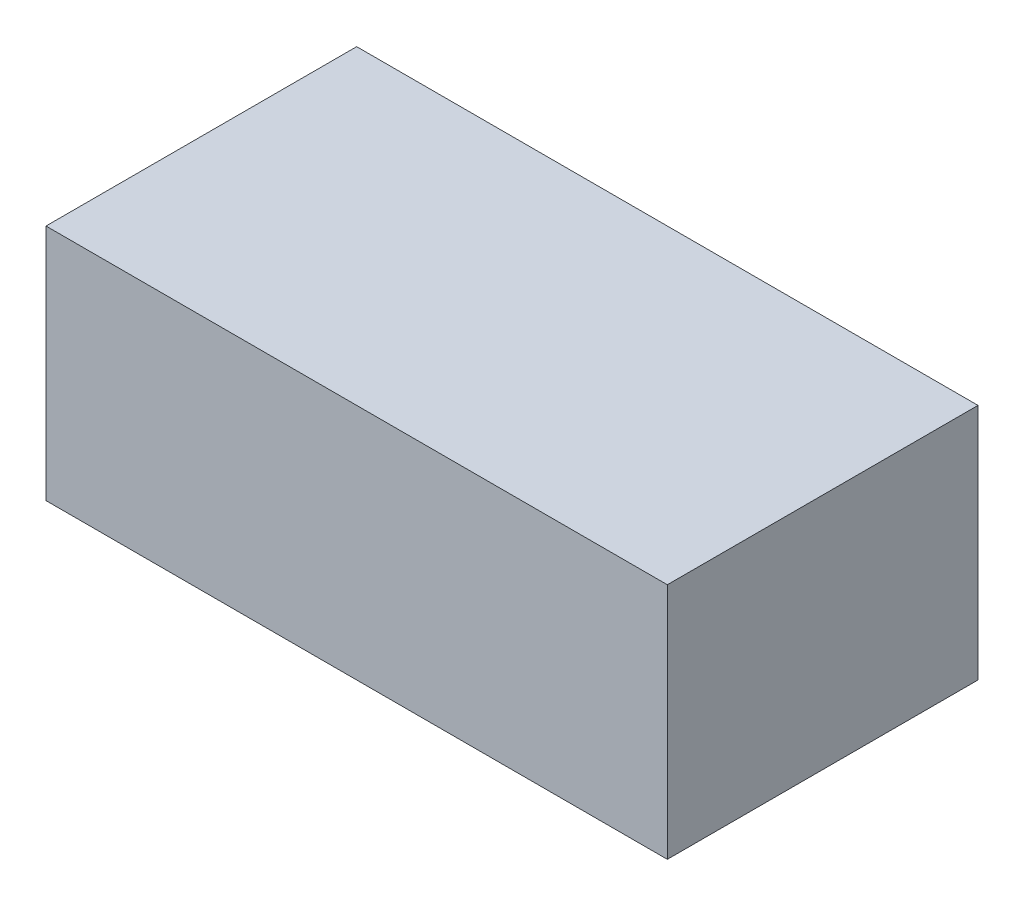
ISO-10303-21;
HEADER;
FILE_DESCRIPTION(('STEP AP214'),'2;1');
FILE_NAME('part.step','',(''),(''),'','','');
FILE_SCHEMA(('AUTOMOTIVE_DESIGN { 1 0 10303 214 1 1 1 1 }'));
ENDSEC;
DATA;
#1=APPLICATION_CONTEXT('core data for automotive mechanical design processes');
#2=APPLICATION_PROTOCOL_DEFINITION('international standard','automotive_design',2000,#1);
#3=PRODUCT_CONTEXT('',#1,'mechanical');
#4=PRODUCT('Part','Part','',(#3));
#5=PRODUCT_RELATED_PRODUCT_CATEGORY('part','',(#4));
#6=PRODUCT_DEFINITION_FORMATION('','',#4);
#7=PRODUCT_DEFINITION_CONTEXT('part definition',#1,'design');
#8=PRODUCT_DEFINITION('design','',#6,#7);
#9=PRODUCT_DEFINITION_SHAPE('','',#8);
#10=(LENGTH_UNIT() NAMED_UNIT(*) SI_UNIT(.MILLI.,.METRE.));
#11=(NAMED_UNIT(*) PLANE_ANGLE_UNIT() SI_UNIT($,.RADIAN.));
#12=(NAMED_UNIT(*) SI_UNIT($,.STERADIAN.) SOLID_ANGLE_UNIT());
#13=UNCERTAINTY_MEASURE_WITH_UNIT(LENGTH_MEASURE(1.E-05),#10,'distance_accuracy_value','');
#14=(GEOMETRIC_REPRESENTATION_CONTEXT(3) GLOBAL_UNCERTAINTY_ASSIGNED_CONTEXT((#13)) GLOBAL_UNIT_ASSIGNED_CONTEXT((#10,
#11,#12)) REPRESENTATION_CONTEXT('',''));
#15=CARTESIAN_POINT('',(0.,0.,0.));
#16=DIRECTION('',(0.,0.,1.));
#17=DIRECTION('',(1.,0.,0.));
#18=AXIS2_PLACEMENT_3D('',#15,#16,#17);
#19=CARTESIAN_POINT('',(145.,111.,72.5));
#20=DIRECTION('',(-1.,0.,0.));
#21=DIRECTION('',(0.,0.,1.));
#22=AXIS2_PLACEMENT_3D('',#19,#20,#21);
#23=PLANE('',#22);
#24=DIRECTION('',(0.,0.,-1.));
#25=VECTOR('',#24,1.);
#26=CARTESIAN_POINT('',(145.,0.,72.5));
#27=LINE('',#26,#25);
#28=CARTESIAN_POINT('',(145.,0.,72.5));
#29=VERTEX_POINT('',#28);
#30=CARTESIAN_POINT('',(145.,0.,-72.5));
#31=VERTEX_POINT('',#30);
#32=EDGE_CURVE('E113',#29,#31,#27,.T.);
#33=ORIENTED_EDGE('',*,*,#32,.T.);
#34=DIRECTION('',(0.,-1.,0.));
#35=VECTOR('',#34,1.);
#36=CARTESIAN_POINT('',(145.,111.,-72.5));
#37=LINE('',#36,#35);
#38=CARTESIAN_POINT('',(145.,111.,-72.5));
#39=VERTEX_POINT('',#38);
#40=EDGE_CURVE('E11',#39,#31,#37,.T.);
#41=ORIENTED_EDGE('',*,*,#40,.F.);
#42=DIRECTION('',(0.,0.,-1.));
#43=VECTOR('',#42,1.);
#44=CARTESIAN_POINT('',(145.,111.,72.5));
#45=LINE('',#44,#43);
#46=CARTESIAN_POINT('',(145.,111.,72.5));
#47=VERTEX_POINT('',#46);
#48=EDGE_CURVE('E97',#47,#39,#45,.T.);
#49=ORIENTED_EDGE('',*,*,#48,.F.);
#50=DIRECTION('',(0.,-1.,0.));
#51=VECTOR('',#50,1.);
#52=CARTESIAN_POINT('',(145.,111.,72.5));
#53=LINE('',#52,#51);
#54=EDGE_CURVE('E109',#47,#29,#53,.T.);
#55=ORIENTED_EDGE('',*,*,#54,.T.);
#56=EDGE_LOOP('',(#33,#41,#49,#55));
#57=FACE_BOUND('',#56,.T.);
#58=ADVANCED_FACE('F45',(#57),#23,.F.);
#59=CARTESIAN_POINT('',(-145.,111.,-72.5));
#60=DIRECTION('',(0.,0.,1.));
#61=DIRECTION('',(1.,0.,0.));
#62=AXIS2_PLACEMENT_3D('',#59,#60,#61);
#63=PLANE('',#62);
#64=DIRECTION('',(-1.,0.,0.));
#65=VECTOR('',#64,1.);
#66=CARTESIAN_POINT('',(-145.,0.,-72.5));
#67=LINE('',#66,#65);
#68=CARTESIAN_POINT('',(-145.,0.,-72.5));
#69=VERTEX_POINT('',#68);
#70=EDGE_CURVE('E102',#31,#69,#67,.T.);
#71=ORIENTED_EDGE('',*,*,#70,.T.);
#72=DIRECTION('',(0.,-1.,0.));
#73=VECTOR('',#72,1.);
#74=CARTESIAN_POINT('',(-145.,111.,-72.5));
#75=LINE('',#74,#73);
#76=CARTESIAN_POINT('',(-145.,111.,-72.5));
#77=VERTEX_POINT('',#76);
#78=EDGE_CURVE('E54',#77,#69,#75,.T.);
#79=ORIENTED_EDGE('',*,*,#78,.F.);
#80=DIRECTION('',(-1.,0.,0.));
#81=VECTOR('',#80,1.);
#82=CARTESIAN_POINT('',(-145.,111.,-72.5));
#83=LINE('',#82,#81);
#84=EDGE_CURVE('E92',#39,#77,#83,.T.);
#85=ORIENTED_EDGE('',*,*,#84,.F.);
#86=ORIENTED_EDGE('',*,*,#40,.T.);
#87=EDGE_LOOP('',(#71,#79,#85,#86));
#88=FACE_BOUND('',#87,.T.);
#89=ADVANCED_FACE('F101',(#88),#63,.F.);
#90=CARTESIAN_POINT('',(-145.,111.,72.5));
#91=DIRECTION('',(1.,0.,0.));
#92=DIRECTION('',(0.,0.,-1.));
#93=AXIS2_PLACEMENT_3D('',#90,#91,#92);
#94=PLANE('',#93);
#95=DIRECTION('',(0.,0.,1.));
#96=VECTOR('',#95,1.);
#97=CARTESIAN_POINT('',(-145.,0.,72.5));
#98=LINE('',#97,#96);
#99=CARTESIAN_POINT('',(-145.,0.,72.5));
#100=VERTEX_POINT('',#99);
#101=EDGE_CURVE('E79',#69,#100,#98,.T.);
#102=ORIENTED_EDGE('',*,*,#101,.T.);
#103=DIRECTION('',(0.,-1.,0.));
#104=VECTOR('',#103,1.);
#105=CARTESIAN_POINT('',(-145.,111.,72.5));
#106=LINE('',#105,#104);
#107=CARTESIAN_POINT('',(-145.,111.,72.5));
#108=VERTEX_POINT('',#107);
#109=EDGE_CURVE('E104',#108,#100,#106,.T.);
#110=ORIENTED_EDGE('',*,*,#109,.F.);
#111=DIRECTION('',(0.,0.,1.));
#112=VECTOR('',#111,1.);
#113=CARTESIAN_POINT('',(-145.,111.,72.5));
#114=LINE('',#113,#112);
#115=EDGE_CURVE('E95',#77,#108,#114,.T.);
#116=ORIENTED_EDGE('',*,*,#115,.F.);
#117=ORIENTED_EDGE('',*,*,#78,.T.);
#118=EDGE_LOOP('',(#102,#110,#116,#117));
#119=FACE_BOUND('',#118,.T.);
#120=ADVANCED_FACE('F105',(#119),#94,.F.);
#121=CARTESIAN_POINT('',(-145.,111.,72.5));
#122=DIRECTION('',(0.,0.,-1.));
#123=DIRECTION('',(-1.,0.,0.));
#124=AXIS2_PLACEMENT_3D('',#121,#122,#123);
#125=PLANE('',#124);
#126=DIRECTION('',(1.,0.,0.));
#127=VECTOR('',#126,1.);
#128=CARTESIAN_POINT('',(-145.,0.,72.5));
#129=LINE('',#128,#127);
#130=EDGE_CURVE('E85',#100,#29,#129,.T.);
#131=ORIENTED_EDGE('',*,*,#130,.T.);
#132=ORIENTED_EDGE('',*,*,#54,.F.);
#133=DIRECTION('',(1.,0.,0.));
#134=VECTOR('',#133,1.);
#135=CARTESIAN_POINT('',(-145.,111.,72.5));
#136=LINE('',#135,#134);
#137=EDGE_CURVE('E62',#108,#47,#136,.T.);
#138=ORIENTED_EDGE('',*,*,#137,.F.);
#139=ORIENTED_EDGE('',*,*,#109,.T.);
#140=EDGE_LOOP('',(#131,#132,#138,#139));
#141=FACE_BOUND('',#140,.T.);
#142=ADVANCED_FACE('F126',(#141),#125,.F.);
#143=CARTESIAN_POINT('',(0.,111.,0.));
#144=DIRECTION('',(0.,-1.,0.));
#145=DIRECTION('',(0.,0.,-1.));
#146=AXIS2_PLACEMENT_3D('',#143,#144,#145);
#147=PLANE('',#146);
#148=ORIENTED_EDGE('',*,*,#48,.T.);
#149=ORIENTED_EDGE('',*,*,#84,.T.);
#150=ORIENTED_EDGE('',*,*,#115,.T.);
#151=ORIENTED_EDGE('',*,*,#137,.T.);
#152=EDGE_LOOP('',(#148,#149,#150,#151));
#153=FACE_BOUND('',#152,.T.);
#154=ADVANCED_FACE('F93',(#153),#147,.F.);
#155=CARTESIAN_POINT('',(0.,0.,0.));
#156=DIRECTION('',(0.,-1.,0.));
#157=DIRECTION('',(0.,0.,-1.));
#158=AXIS2_PLACEMENT_3D('',#155,#156,#157);
#159=PLANE('',#158);
#160=ORIENTED_EDGE('',*,*,#32,.F.);
#161=ORIENTED_EDGE('',*,*,#130,.F.);
#162=ORIENTED_EDGE('',*,*,#101,.F.);
#163=ORIENTED_EDGE('',*,*,#70,.F.);
#164=EDGE_LOOP('',(#160,#161,#162,#163));
#165=FACE_BOUND('',#164,.T.);
#166=ADVANCED_FACE('F129',(#165),#159,.T.);
#167=CLOSED_SHELL('',(#58,#89,#120,#142,#154,#166));
#168=MANIFOLD_SOLID_BREP('B2',#167);
#169=ADVANCED_BREP_SHAPE_REPRESENTATION('',(#18,#168),#14);
#170=SHAPE_DEFINITION_REPRESENTATION(#9,#169);
ENDSEC;
END-ISO-10303-21;
